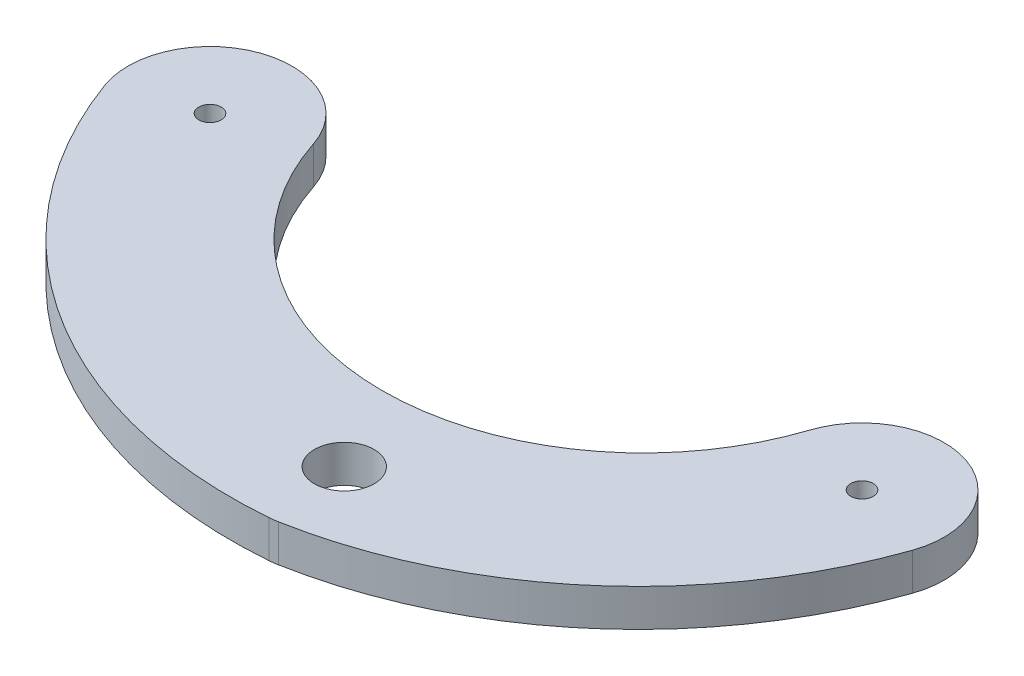
ISO-10303-21;
HEADER;
FILE_DESCRIPTION(('STEP AP214'),'2;1');
FILE_NAME('part.step','',(''),(''),'','','');
FILE_SCHEMA(('AUTOMOTIVE_DESIGN { 1 0 10303 214 1 1 1 1 }'));
ENDSEC;
DATA;
#1=APPLICATION_CONTEXT('core data for automotive mechanical design processes');
#2=APPLICATION_PROTOCOL_DEFINITION('international standard','automotive_design',2000,#1);
#3=PRODUCT_CONTEXT('',#1,'mechanical');
#4=PRODUCT('Part','Part','',(#3));
#5=PRODUCT_RELATED_PRODUCT_CATEGORY('part','',(#4));
#6=PRODUCT_DEFINITION_FORMATION('','',#4);
#7=PRODUCT_DEFINITION_CONTEXT('part definition',#1,'design');
#8=PRODUCT_DEFINITION('design','',#6,#7);
#9=PRODUCT_DEFINITION_SHAPE('','',#8);
#10=(LENGTH_UNIT() NAMED_UNIT(*) SI_UNIT(.MILLI.,.METRE.));
#11=(NAMED_UNIT(*) PLANE_ANGLE_UNIT() SI_UNIT($,.RADIAN.));
#12=(NAMED_UNIT(*) SI_UNIT($,.STERADIAN.) SOLID_ANGLE_UNIT());
#13=UNCERTAINTY_MEASURE_WITH_UNIT(LENGTH_MEASURE(1.E-05),#10,'distance_accuracy_value','');
#14=(GEOMETRIC_REPRESENTATION_CONTEXT(3) GLOBAL_UNCERTAINTY_ASSIGNED_CONTEXT((#13)) GLOBAL_UNIT_ASSIGNED_CONTEXT((#10,
#11,#12)) REPRESENTATION_CONTEXT('',''));
#15=CARTESIAN_POINT('',(0.,0.,0.));
#16=DIRECTION('',(0.,0.,1.));
#17=DIRECTION('',(1.,0.,0.));
#18=AXIS2_PLACEMENT_3D('',#15,#16,#17);
#19=CARTESIAN_POINT('',(50.,5.,32.));
#20=DIRECTION('',(0.,-1.,0.));
#21=DIRECTION('',(0.,0.,-1.));
#22=AXIS2_PLACEMENT_3D('',#19,#20,#21);
#23=CYLINDRICAL_SURFACE('',#22,11.);
#24=CARTESIAN_POINT('',(50.,0.,32.));
#25=DIRECTION('',(0.,1.,0.));
#26=DIRECTION('',(0.,0.,1.));
#27=AXIS2_PLACEMENT_3D('',#24,#25,#26);
#28=CIRCLE('',#27,11.);
#29=CARTESIAN_POINT('',(50.8943264719736,0.,42.9635842752964));
#30=VERTEX_POINT('',#29);
#31=CARTESIAN_POINT('',(51.9859216370106,0.,42.8192474438684));
#32=VERTEX_POINT('',#31);
#33=EDGE_CURVE('E148',#30,#32,#28,.T.);
#34=ORIENTED_EDGE('',*,*,#33,.T.);
#35=DIRECTION('',(0.,-1.,0.));
#36=VECTOR('',#35,1.);
#37=CARTESIAN_POINT('',(51.9859216370106,5.,42.8192474438684));
#38=LINE('',#37,#36);
#39=CARTESIAN_POINT('',(51.9859216370106,5.,42.8192474438684));
#40=VERTEX_POINT('',#39);
#41=EDGE_CURVE('E11',#40,#32,#38,.T.);
#42=ORIENTED_EDGE('',*,*,#41,.F.);
#43=CARTESIAN_POINT('',(50.,5.,32.));
#44=DIRECTION('',(0.,1.,0.));
#45=DIRECTION('',(0.,0.,1.));
#46=AXIS2_PLACEMENT_3D('',#43,#44,#45);
#47=CIRCLE('',#46,11.);
#48=CARTESIAN_POINT('',(50.8943264719736,5.,42.9635842752964));
#49=VERTEX_POINT('',#48);
#50=EDGE_CURVE('E182',#49,#40,#47,.T.);
#51=ORIENTED_EDGE('',*,*,#50,.F.);
#52=DIRECTION('',(0.,-1.,0.));
#53=VECTOR('',#52,1.);
#54=CARTESIAN_POINT('',(50.8943264719736,5.,42.9635842752964));
#55=LINE('',#54,#53);
#56=EDGE_CURVE('E135',#49,#30,#55,.T.);
#57=ORIENTED_EDGE('',*,*,#56,.T.);
#58=EDGE_LOOP('',(#34,#42,#51,#57));
#59=FACE_BOUND('',#58,.T.);
#60=ADVANCED_FACE('F45',(#59),#23,.T.);
#61=CARTESIAN_POINT('',(41.1536217987709,5.,-16.1948295226865));
#62=DIRECTION('',(0.,-1.,0.));
#63=DIRECTION('',(0.,0.,-1.));
#64=AXIS2_PLACEMENT_3D('',#61,#62,#63);
#65=CYLINDRICAL_SURFACE('',#64,60.);
#66=CARTESIAN_POINT('',(41.1536217987709,0.,-16.1948295226865));
#67=DIRECTION('',(0.,1.,0.));
#68=DIRECTION('',(0.,0.,1.));
#69=AXIS2_PLACEMENT_3D('',#66,#67,#68);
#70=CIRCLE('',#69,60.);
#71=CARTESIAN_POINT('',(97.7818400043575,0.,3.63557397448065));
#72=VERTEX_POINT('',#71);
#73=EDGE_CURVE('E152',#32,#72,#70,.T.);
#74=ORIENTED_EDGE('',*,*,#73,.T.);
#75=DIRECTION('',(0.,-1.,0.));
#76=VECTOR('',#75,1.);
#77=CARTESIAN_POINT('',(97.7818400043575,5.,3.63557397448065));
#78=LINE('',#77,#76);
#79=CARTESIAN_POINT('',(97.7818400043575,5.,3.63557397448065));
#80=VERTEX_POINT('',#79);
#81=EDGE_CURVE('E55',#80,#72,#78,.T.);
#82=ORIENTED_EDGE('',*,*,#81,.F.);
#83=CARTESIAN_POINT('',(41.1536217987709,5.,-16.1948295226865));
#84=DIRECTION('',(0.,1.,0.));
#85=DIRECTION('',(0.,0.,1.));
#86=AXIS2_PLACEMENT_3D('',#83,#84,#85);
#87=CIRCLE('',#86,60.);
#88=EDGE_CURVE('E99',#40,#80,#87,.T.);
#89=ORIENTED_EDGE('',*,*,#88,.F.);
#90=ORIENTED_EDGE('',*,*,#41,.T.);
#91=EDGE_LOOP('',(#74,#82,#89,#90));
#92=FACE_BOUND('',#91,.T.);
#93=ADVANCED_FACE('F197',(#92),#65,.T.);
#94=CARTESIAN_POINT('',(87.4,5.,0.));
#95=DIRECTION('',(0.,-1.,0.));
#96=DIRECTION('',(0.,0.,-1.));
#97=AXIS2_PLACEMENT_3D('',#94,#95,#96);
#98=CYLINDRICAL_SURFACE('',#97,11.);
#99=CARTESIAN_POINT('',(87.4,0.,0.));
#100=DIRECTION('',(0.,1.,0.));
#101=DIRECTION('',(0.,0.,1.));
#102=AXIS2_PLACEMENT_3D('',#99,#100,#101);
#103=CIRCLE('',#102,11.);
#104=CARTESIAN_POINT('',(76.95,0.,-3.43474889911912));
#105=VERTEX_POINT('',#104);
#106=EDGE_CURVE('E155',#72,#105,#103,.T.);
#107=ORIENTED_EDGE('',*,*,#106,.T.);
#108=DIRECTION('',(0.,-1.,0.));
#109=VECTOR('',#108,1.);
#110=CARTESIAN_POINT('',(76.95,5.,-3.43474889911912));
#111=LINE('',#110,#109);
#112=CARTESIAN_POINT('',(76.95,5.,-3.43474889911912));
#113=VERTEX_POINT('',#112);
#114=EDGE_CURVE('E116',#113,#105,#111,.T.);
#115=ORIENTED_EDGE('',*,*,#114,.F.);
#116=CARTESIAN_POINT('',(87.4,5.,0.));
#117=DIRECTION('',(0.,1.,0.));
#118=DIRECTION('',(0.,0.,1.));
#119=AXIS2_PLACEMENT_3D('',#116,#117,#118);
#120=CIRCLE('',#119,11.);
#121=EDGE_CURVE('E125',#80,#113,#120,.T.);
#122=ORIENTED_EDGE('',*,*,#121,.F.);
#123=ORIENTED_EDGE('',*,*,#81,.T.);
#124=EDGE_LOOP('',(#107,#115,#122,#123));
#125=FACE_BOUND('',#124,.T.);
#126=ADVANCED_FACE('F175',(#125),#98,.T.);
#127=CARTESIAN_POINT('',(43.7,5.,-14.3634953963163));
#128=DIRECTION('',(0.,-1.,0.));
#129=DIRECTION('',(0.,0.,-1.));
#130=AXIS2_PLACEMENT_3D('',#127,#128,#129);
#131=CYLINDRICAL_SURFACE('',#130,35.);
#132=CARTESIAN_POINT('',(43.7,0.,-14.3634953963163));
#133=DIRECTION('',(0.,1.,0.));
#134=DIRECTION('',(0.,0.,1.));
#135=AXIS2_PLACEMENT_3D('',#132,#133,#134);
#136=CIRCLE('',#135,35.);
#137=CARTESIAN_POINT('',(10.45,0.,-3.43474889911912));
#138=VERTEX_POINT('',#137);
#139=EDGE_CURVE('E114',#138,#105,#136,.T.);
#140=ORIENTED_EDGE('',*,*,#139,.F.);
#141=DIRECTION('',(0.,-1.,0.));
#142=VECTOR('',#141,1.);
#143=CARTESIAN_POINT('',(10.45,5.,-3.43474889911912));
#144=LINE('',#143,#142);
#145=CARTESIAN_POINT('',(10.45,5.,-3.43474889911912));
#146=VERTEX_POINT('',#145);
#147=EDGE_CURVE('E108',#146,#138,#144,.T.);
#148=ORIENTED_EDGE('',*,*,#147,.F.);
#149=CARTESIAN_POINT('',(43.7,5.,-14.3634953963163));
#150=DIRECTION('',(0.,1.,0.));
#151=DIRECTION('',(0.,0.,1.));
#152=AXIS2_PLACEMENT_3D('',#149,#150,#151);
#153=CIRCLE('',#152,35.);
#154=EDGE_CURVE('E112',#146,#113,#153,.T.);
#155=ORIENTED_EDGE('',*,*,#154,.T.);
#156=ORIENTED_EDGE('',*,*,#114,.T.);
#157=EDGE_LOOP('',(#140,#148,#155,#156));
#158=FACE_BOUND('',#157,.T.);
#159=ADVANCED_FACE('F110',(#158),#131,.F.);
#160=CARTESIAN_POINT('',(0.,5.,0.));
#161=DIRECTION('',(0.,-1.,0.));
#162=DIRECTION('',(0.,0.,-1.));
#163=AXIS2_PLACEMENT_3D('',#160,#161,#162);
#164=CYLINDRICAL_SURFACE('',#163,11.);
#165=CARTESIAN_POINT('',(0.,0.,0.));
#166=DIRECTION('',(0.,1.,0.));
#167=DIRECTION('',(0.,0.,1.));
#168=AXIS2_PLACEMENT_3D('',#165,#166,#167);
#169=CIRCLE('',#168,11.);
#170=CARTESIAN_POINT('',(-10.3301633239448,0.,3.77991080590868));
#171=VERTEX_POINT('',#170);
#172=EDGE_CURVE('E85',#138,#171,#169,.T.);
#173=ORIENTED_EDGE('',*,*,#172,.T.);
#174=DIRECTION('',(0.,-1.,0.));
#175=VECTOR('',#174,1.);
#176=CARTESIAN_POINT('',(-10.3301633239448,5.,3.77991080590868));
#177=LINE('',#176,#175);
#178=CARTESIAN_POINT('',(-10.3301633239448,5.,3.77991080590868));
#179=VERTEX_POINT('',#178);
#180=EDGE_CURVE('E117',#179,#171,#177,.T.);
#181=ORIENTED_EDGE('',*,*,#180,.F.);
#182=CARTESIAN_POINT('',(0.,5.,0.));
#183=DIRECTION('',(0.,1.,0.));
#184=DIRECTION('',(0.,0.,1.));
#185=AXIS2_PLACEMENT_3D('',#182,#183,#184);
#186=CIRCLE('',#185,11.);
#187=EDGE_CURVE('E119',#146,#179,#186,.T.);
#188=ORIENTED_EDGE('',*,*,#187,.F.);
#189=ORIENTED_EDGE('',*,*,#147,.T.);
#190=EDGE_LOOP('',(#173,#181,#188,#189));
#191=FACE_BOUND('',#190,.T.);
#192=ADVANCED_FACE('F120',(#191),#164,.T.);
#193=CARTESIAN_POINT('',(50.,5.,32.));
#194=DIRECTION('',(0.,-1.,0.));
#195=DIRECTION('',(0.,0.,-1.));
#196=AXIS2_PLACEMENT_3D('',#193,#194,#195);
#197=CYLINDRICAL_SURFACE('',#196,4.);
#198=CARTESIAN_POINT('',(50.,5.,32.));
#199=DIRECTION('',(0.,1.,0.));
#200=DIRECTION('',(0.,0.,1.));
#201=AXIS2_PLACEMENT_3D('',#198,#199,#200);
#202=CIRCLE('',#201,4.);
#203=CARTESIAN_POINT('',(50.,5.,36.));
#204=VERTEX_POINT('',#203);
#205=EDGE_CURVE('E313',#204,#204,#202,.T.);
#206=ORIENTED_EDGE('',*,*,#205,.T.);
#207=EDGE_LOOP('',(#206));
#208=FACE_BOUND('',#207,.T.);
#209=CARTESIAN_POINT('',(50.,0.,32.));
#210=DIRECTION('',(0.,1.,0.));
#211=DIRECTION('',(0.,0.,1.));
#212=AXIS2_PLACEMENT_3D('',#209,#210,#211);
#213=CIRCLE('',#212,4.);
#214=CARTESIAN_POINT('',(50.,0.,36.));
#215=VERTEX_POINT('',#214);
#216=EDGE_CURVE('E144',#215,#215,#213,.T.);
#217=ORIENTED_EDGE('',*,*,#216,.F.);
#218=EDGE_LOOP('',(#217));
#219=FACE_BOUND('',#218,.T.);
#220=ADVANCED_FACE('F205',(#208,#219),#197,.F.);
#221=CARTESIAN_POINT('',(87.4,5.,0.));
#222=DIRECTION('',(0.,-1.,0.));
#223=DIRECTION('',(0.,0.,-1.));
#224=AXIS2_PLACEMENT_3D('',#221,#222,#223);
#225=CYLINDRICAL_SURFACE('',#224,1.5);
#226=CARTESIAN_POINT('',(87.4,5.,0.));
#227=DIRECTION('',(0.,1.,0.));
#228=DIRECTION('',(0.,0.,1.));
#229=AXIS2_PLACEMENT_3D('',#226,#227,#228);
#230=CIRCLE('',#229,1.5);
#231=CARTESIAN_POINT('',(87.4,5.,1.5));
#232=VERTEX_POINT('',#231);
#233=EDGE_CURVE('E215',#232,#232,#230,.T.);
#234=ORIENTED_EDGE('',*,*,#233,.T.);
#235=EDGE_LOOP('',(#234));
#236=FACE_BOUND('',#235,.T.);
#237=CARTESIAN_POINT('',(87.4,0.,0.));
#238=DIRECTION('',(0.,1.,0.));
#239=DIRECTION('',(0.,0.,1.));
#240=AXIS2_PLACEMENT_3D('',#237,#238,#239);
#241=CIRCLE('',#240,1.5);
#242=CARTESIAN_POINT('',(87.4,0.,1.5));
#243=VERTEX_POINT('',#242);
#244=EDGE_CURVE('E140',#243,#243,#241,.T.);
#245=ORIENTED_EDGE('',*,*,#244,.F.);
#246=EDGE_LOOP('',(#245));
#247=FACE_BOUND('',#246,.T.);
#248=ADVANCED_FACE('F192',(#236,#247),#225,.F.);
#249=CARTESIAN_POINT('',(0.,5.,0.));
#250=DIRECTION('',(0.,-1.,0.));
#251=DIRECTION('',(0.,0.,-1.));
#252=AXIS2_PLACEMENT_3D('',#249,#250,#251);
#253=CYLINDRICAL_SURFACE('',#252,1.5);
#254=CARTESIAN_POINT('',(0.,5.,0.));
#255=DIRECTION('',(0.,1.,0.));
#256=DIRECTION('',(0.,0.,1.));
#257=AXIS2_PLACEMENT_3D('',#254,#255,#256);
#258=CIRCLE('',#257,1.5);
#259=CARTESIAN_POINT('',(0.,5.,1.5));
#260=VERTEX_POINT('',#259);
#261=EDGE_CURVE('E165',#260,#260,#258,.T.);
#262=ORIENTED_EDGE('',*,*,#261,.T.);
#263=EDGE_LOOP('',(#262));
#264=FACE_BOUND('',#263,.T.);
#265=CARTESIAN_POINT('',(0.,0.,0.));
#266=DIRECTION('',(0.,1.,0.));
#267=DIRECTION('',(0.,0.,1.));
#268=AXIS2_PLACEMENT_3D('',#265,#266,#267);
#269=CIRCLE('',#268,1.5);
#270=CARTESIAN_POINT('',(0.,0.,1.5));
#271=VERTEX_POINT('',#270);
#272=EDGE_CURVE('E136',#271,#271,#269,.T.);
#273=ORIENTED_EDGE('',*,*,#272,.F.);
#274=EDGE_LOOP('',(#273));
#275=FACE_BOUND('',#274,.T.);
#276=ADVANCED_FACE('F47',(#264,#275),#253,.F.);
#277=CARTESIAN_POINT('',(46.0161820793906,5.,-16.8377844990478));
#278=DIRECTION('',(0.,-1.,0.));
#279=DIRECTION('',(0.,0.,-1.));
#280=AXIS2_PLACEMENT_3D('',#277,#278,#279);
#281=CYLINDRICAL_SURFACE('',#280,60.);
#282=CARTESIAN_POINT('',(46.0161820793906,0.,-16.8377844990478));
#283=DIRECTION('',(0.,1.,0.));
#284=DIRECTION('',(0.,0.,1.));
#285=AXIS2_PLACEMENT_3D('',#282,#283,#284);
#286=CIRCLE('',#285,60.);
#287=EDGE_CURVE('E91',#171,#30,#286,.T.);
#288=ORIENTED_EDGE('',*,*,#287,.T.);
#289=ORIENTED_EDGE('',*,*,#56,.F.);
#290=CARTESIAN_POINT('',(46.0161820793906,5.,-16.8377844990478));
#291=DIRECTION('',(0.,1.,0.));
#292=DIRECTION('',(0.,0.,1.));
#293=AXIS2_PLACEMENT_3D('',#290,#291,#292);
#294=CIRCLE('',#293,60.);
#295=EDGE_CURVE('E63',#179,#49,#294,.T.);
#296=ORIENTED_EDGE('',*,*,#295,.F.);
#297=ORIENTED_EDGE('',*,*,#180,.T.);
#298=EDGE_LOOP('',(#288,#289,#296,#297));
#299=FACE_BOUND('',#298,.T.);
#300=ADVANCED_FACE('F183',(#299),#281,.T.);
#301=CARTESIAN_POINT('',(0.,5.,0.));
#302=DIRECTION('',(0.,1.,0.));
#303=DIRECTION('',(0.,0.,1.));
#304=AXIS2_PLACEMENT_3D('',#301,#302,#303);
#305=PLANE('',#304);
#306=ORIENTED_EDGE('',*,*,#261,.F.);
#307=EDGE_LOOP('',(#306));
#308=FACE_BOUND('',#307,.T.);
#309=ORIENTED_EDGE('',*,*,#233,.F.);
#310=EDGE_LOOP('',(#309));
#311=FACE_BOUND('',#310,.T.);
#312=ORIENTED_EDGE('',*,*,#205,.F.);
#313=EDGE_LOOP('',(#312));
#314=FACE_BOUND('',#313,.T.);
#315=ORIENTED_EDGE('',*,*,#50,.T.);
#316=ORIENTED_EDGE('',*,*,#88,.T.);
#317=ORIENTED_EDGE('',*,*,#121,.T.);
#318=ORIENTED_EDGE('',*,*,#154,.F.);
#319=ORIENTED_EDGE('',*,*,#187,.T.);
#320=ORIENTED_EDGE('',*,*,#295,.T.);
#321=EDGE_LOOP('',(#315,#316,#317,#318,#319,#320));
#322=FACE_BOUND('',#321,.T.);
#323=ADVANCED_FACE('F123',(#308,#311,#314,#322),#305,.T.);
#324=CARTESIAN_POINT('',(0.,0.,0.));
#325=DIRECTION('',(0.,1.,0.));
#326=DIRECTION('',(0.,0.,1.));
#327=AXIS2_PLACEMENT_3D('',#324,#325,#326);
#328=PLANE('',#327);
#329=ORIENTED_EDGE('',*,*,#272,.T.);
#330=EDGE_LOOP('',(#329));
#331=FACE_BOUND('',#330,.T.);
#332=ORIENTED_EDGE('',*,*,#244,.T.);
#333=EDGE_LOOP('',(#332));
#334=FACE_BOUND('',#333,.T.);
#335=ORIENTED_EDGE('',*,*,#216,.T.);
#336=EDGE_LOOP('',(#335));
#337=FACE_BOUND('',#336,.T.);
#338=ORIENTED_EDGE('',*,*,#33,.F.);
#339=ORIENTED_EDGE('',*,*,#287,.F.);
#340=ORIENTED_EDGE('',*,*,#172,.F.);
#341=ORIENTED_EDGE('',*,*,#139,.T.);
#342=ORIENTED_EDGE('',*,*,#106,.F.);
#343=ORIENTED_EDGE('',*,*,#73,.F.);
#344=EDGE_LOOP('',(#338,#339,#340,#341,#342,#343));
#345=FACE_BOUND('',#344,.T.);
#346=ADVANCED_FACE('F178',(#331,#334,#337,#345),#328,.F.);
#347=CLOSED_SHELL('',(#60,#93,#126,#159,#192,#220,#248,#276,#300,#323,#346));
#348=MANIFOLD_SOLID_BREP('B2',#347);
#349=ADVANCED_BREP_SHAPE_REPRESENTATION('',(#18,#348),#14);
#350=SHAPE_DEFINITION_REPRESENTATION(#9,#349);
ENDSEC;
END-ISO-10303-21;
